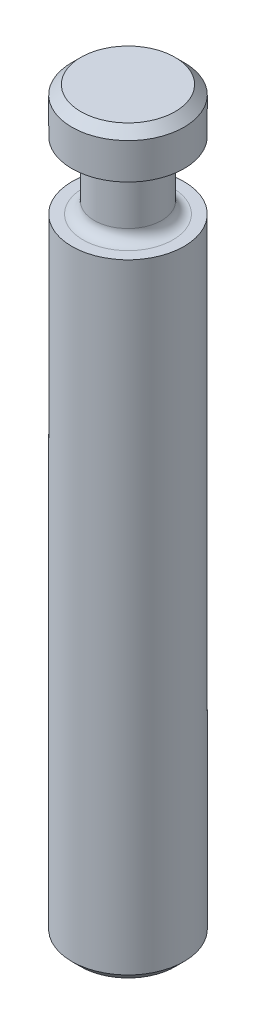
ISO-10303-21;
HEADER;
FILE_DESCRIPTION(('STEP AP214'),'2;1');
FILE_NAME('part.step','',(''),(''),'','','');
FILE_SCHEMA(('AUTOMOTIVE_DESIGN { 1 0 10303 214 1 1 1 1 }'));
ENDSEC;
DATA;
#1=APPLICATION_CONTEXT('core data for automotive mechanical design processes');
#2=APPLICATION_PROTOCOL_DEFINITION('international standard','automotive_design',2000,#1);
#3=PRODUCT_CONTEXT('',#1,'mechanical');
#4=PRODUCT('Part','Part','',(#3));
#5=PRODUCT_RELATED_PRODUCT_CATEGORY('part','',(#4));
#6=PRODUCT_DEFINITION_FORMATION('','',#4);
#7=PRODUCT_DEFINITION_CONTEXT('part definition',#1,'design');
#8=PRODUCT_DEFINITION('design','',#6,#7);
#9=PRODUCT_DEFINITION_SHAPE('','',#8);
#10=(LENGTH_UNIT() NAMED_UNIT(*) SI_UNIT(.MILLI.,.METRE.));
#11=(NAMED_UNIT(*) PLANE_ANGLE_UNIT() SI_UNIT($,.RADIAN.));
#12=(NAMED_UNIT(*) SI_UNIT($,.STERADIAN.) SOLID_ANGLE_UNIT());
#13=UNCERTAINTY_MEASURE_WITH_UNIT(LENGTH_MEASURE(1.E-05),#10,'distance_accuracy_value','');
#14=(GEOMETRIC_REPRESENTATION_CONTEXT(3) GLOBAL_UNCERTAINTY_ASSIGNED_CONTEXT((#13)) GLOBAL_UNIT_ASSIGNED_CONTEXT((#10,
#11,#12)) REPRESENTATION_CONTEXT('',''));
#15=CARTESIAN_POINT('',(0.,0.,0.));
#16=DIRECTION('',(0.,0.,1.));
#17=DIRECTION('',(1.,0.,0.));
#18=AXIS2_PLACEMENT_3D('',#15,#16,#17);
#19=CARTESIAN_POINT('',(0.,-16.5,0.));
#20=DIRECTION('',(0.,1.,0.));
#21=DIRECTION('',(0.,0.,1.));
#22=AXIS2_PLACEMENT_3D('',#19,#20,#21);
#23=CYLINDRICAL_SURFACE('',#22,1.25);
#24=CARTESIAN_POINT('',(0.,-0.200000000000002,0.));
#25=DIRECTION('',(0.,1.,0.));
#26=DIRECTION('',(0.,0.,1.));
#27=AXIS2_PLACEMENT_3D('',#24,#25,#26);
#28=CIRCLE('',#27,1.25);
#29=CARTESIAN_POINT('',(0.,-0.200000000000002,1.25));
#30=VERTEX_POINT('',#29);
#31=EDGE_CURVE('E59',#30,#30,#28,.F.);
#32=ORIENTED_EDGE('',*,*,#31,.T.);
#33=EDGE_LOOP('',(#32));
#34=FACE_BOUND('',#33,.T.);
#35=CARTESIAN_POINT('',(0.,-1.,0.));
#36=DIRECTION('',(0.,-1.,0.));
#37=DIRECTION('',(0.,0.,-1.));
#38=AXIS2_PLACEMENT_3D('',#35,#36,#37);
#39=CIRCLE('',#38,1.25);
#40=CARTESIAN_POINT('',(0.,-1.,-1.25));
#41=VERTEX_POINT('',#40);
#42=EDGE_CURVE('E62',#41,#41,#39,.T.);
#43=ORIENTED_EDGE('',*,*,#42,.F.);
#44=EDGE_LOOP('',(#43));
#45=FACE_BOUND('',#44,.T.);
#46=ADVANCED_FACE('F30',(#34,#45),#23,.T.);
#47=CARTESIAN_POINT('',(0.,0.,0.));
#48=DIRECTION('',(0.,1.,0.));
#49=DIRECTION('',(0.,0.,1.));
#50=AXIS2_PLACEMENT_3D('',#47,#48,#49);
#51=PLANE('',#50);
#52=CARTESIAN_POINT('',(0.,0.,0.));
#53=DIRECTION('',(0.,1.,0.));
#54=DIRECTION('',(0.,0.,1.));
#55=AXIS2_PLACEMENT_3D('',#52,#53,#54);
#56=CIRCLE('',#55,1.05);
#57=CARTESIAN_POINT('',(0.,0.,1.05));
#58=VERTEX_POINT('',#57);
#59=EDGE_CURVE('E50',#58,#58,#56,.T.);
#60=ORIENTED_EDGE('',*,*,#59,.T.);
#61=EDGE_LOOP('',(#60));
#62=FACE_BOUND('',#61,.T.);
#63=ADVANCED_FACE('F72',(#62),#51,.T.);
#64=CARTESIAN_POINT('',(0.,0.,0.));
#65=DIRECTION('',(0.,-1.,0.));
#66=DIRECTION('',(0.,0.,-1.));
#67=AXIS2_PLACEMENT_3D('',#64,#65,#66);
#68=CONICAL_SURFACE('',#67,1.05,0.785398163397446);
#69=ORIENTED_EDGE('',*,*,#31,.F.);
#70=EDGE_LOOP('',(#69));
#71=FACE_BOUND('',#70,.T.);
#72=ORIENTED_EDGE('',*,*,#59,.F.);
#73=EDGE_LOOP('',(#72));
#74=FACE_BOUND('',#73,.T.);
#75=ADVANCED_FACE('F79',(#71,#74),#68,.T.);
#76=CARTESIAN_POINT('',(0.,-1.,0.));
#77=DIRECTION('',(0.,-1.,0.));
#78=DIRECTION('',(0.,0.,-1.));
#79=AXIS2_PLACEMENT_3D('',#76,#77,#78);
#80=PLANE('',#79);
#81=CARTESIAN_POINT('',(0.,-1.,0.));
#82=DIRECTION('',(0.,-1.,0.));
#83=DIRECTION('',(0.,0.,-1.));
#84=AXIS2_PLACEMENT_3D('',#81,#82,#83);
#85=CIRCLE('',#84,1.);
#86=CARTESIAN_POINT('',(0.,-1.,-1.));
#87=VERTEX_POINT('',#86);
#88=EDGE_CURVE('E37',#87,#87,#85,.F.);
#89=ORIENTED_EDGE('',*,*,#88,.T.);
#90=EDGE_LOOP('',(#89));
#91=FACE_BOUND('',#90,.T.);
#92=ORIENTED_EDGE('',*,*,#42,.T.);
#93=EDGE_LOOP('',(#92));
#94=FACE_BOUND('',#93,.T.);
#95=ADVANCED_FACE('F69',(#91,#94),#80,.T.);
#96=CARTESIAN_POINT('',(0.,-2.5,0.));
#97=DIRECTION('',(0.,-1.,0.));
#98=DIRECTION('',(0.,0.,-1.));
#99=AXIS2_PLACEMENT_3D('',#96,#97,#98);
#100=PLANE('',#99);
#101=CARTESIAN_POINT('',(0.,-2.5,0.));
#102=DIRECTION('',(0.,-1.,0.));
#103=DIRECTION('',(0.,0.,-1.));
#104=AXIS2_PLACEMENT_3D('',#101,#102,#103);
#105=CIRCLE('',#104,1.);
#106=CARTESIAN_POINT('',(0.,-2.5,-1.));
#107=VERTEX_POINT('',#106);
#108=EDGE_CURVE('E10',#107,#107,#105,.T.);
#109=ORIENTED_EDGE('',*,*,#108,.T.);
#110=EDGE_LOOP('',(#109));
#111=FACE_BOUND('',#110,.T.);
#112=CARTESIAN_POINT('',(0.,-2.5,0.));
#113=DIRECTION('',(0.,-1.,0.));
#114=DIRECTION('',(0.,0.,-1.));
#115=AXIS2_PLACEMENT_3D('',#112,#113,#114);
#116=CIRCLE('',#115,1.25);
#117=CARTESIAN_POINT('',(0.,-2.5,-1.25));
#118=VERTEX_POINT('',#117);
#119=EDGE_CURVE('E63',#118,#118,#116,.T.);
#120=ORIENTED_EDGE('',*,*,#119,.F.);
#121=EDGE_LOOP('',(#120));
#122=FACE_BOUND('',#121,.T.);
#123=ADVANCED_FACE('F99',(#111,#122),#100,.F.);
#124=CARTESIAN_POINT('',(0.,-1.,0.));
#125=DIRECTION('',(0.,-1.,0.));
#126=DIRECTION('',(0.,0.,-1.));
#127=AXIS2_PLACEMENT_3D('',#124,#125,#126);
#128=CYLINDRICAL_SURFACE('',#127,0.75);
#129=CARTESIAN_POINT('',(0.,-1.25,0.));
#130=DIRECTION('',(0.,-1.,0.));
#131=DIRECTION('',(0.,0.,-1.));
#132=AXIS2_PLACEMENT_3D('',#129,#130,#131);
#133=CIRCLE('',#132,0.75);
#134=CARTESIAN_POINT('',(0.,-1.25,-0.75));
#135=VERTEX_POINT('',#134);
#136=EDGE_CURVE('E41',#135,#135,#133,.T.);
#137=ORIENTED_EDGE('',*,*,#136,.T.);
#138=EDGE_LOOP('',(#137));
#139=FACE_BOUND('',#138,.T.);
#140=CARTESIAN_POINT('',(0.,-2.25,0.));
#141=DIRECTION('',(0.,-1.,0.));
#142=DIRECTION('',(0.,0.,-1.));
#143=AXIS2_PLACEMENT_3D('',#140,#141,#142);
#144=CIRCLE('',#143,0.75);
#145=CARTESIAN_POINT('',(0.,-2.25,-0.75));
#146=VERTEX_POINT('',#145);
#147=EDGE_CURVE('E45',#146,#146,#144,.F.);
#148=ORIENTED_EDGE('',*,*,#147,.T.);
#149=EDGE_LOOP('',(#148));
#150=FACE_BOUND('',#149,.T.);
#151=ADVANCED_FACE('F101',(#139,#150),#128,.T.);
#152=CARTESIAN_POINT('',(0.,-16.5,0.));
#153=DIRECTION('',(0.,1.,0.));
#154=DIRECTION('',(0.,0.,1.));
#155=AXIS2_PLACEMENT_3D('',#152,#153,#154);
#156=PLANE('',#155);
#157=CARTESIAN_POINT('',(0.,-16.5,0.));
#158=DIRECTION('',(0.,1.,0.));
#159=DIRECTION('',(0.,0.,1.));
#160=AXIS2_PLACEMENT_3D('',#157,#158,#159);
#161=CIRCLE('',#160,1.05);
#162=CARTESIAN_POINT('',(0.,-16.5,1.05));
#163=VERTEX_POINT('',#162);
#164=EDGE_CURVE('E53',#163,#163,#161,.F.);
#165=ORIENTED_EDGE('',*,*,#164,.T.);
#166=EDGE_LOOP('',(#165));
#167=FACE_BOUND('',#166,.T.);
#168=ADVANCED_FACE('F92',(#167),#156,.F.);
#169=CARTESIAN_POINT('',(0.,-16.3,0.));
#170=DIRECTION('',(0.,1.,0.));
#171=DIRECTION('',(0.,0.,1.));
#172=AXIS2_PLACEMENT_3D('',#169,#170,#171);
#173=CONICAL_SURFACE('',#172,1.25,0.785398163397446);
#174=ORIENTED_EDGE('',*,*,#164,.F.);
#175=EDGE_LOOP('',(#174));
#176=FACE_BOUND('',#175,.T.);
#177=CARTESIAN_POINT('',(0.,-16.3,0.));
#178=DIRECTION('',(0.,1.,0.));
#179=DIRECTION('',(0.,0.,1.));
#180=AXIS2_PLACEMENT_3D('',#177,#178,#179);
#181=CIRCLE('',#180,1.25);
#182=CARTESIAN_POINT('',(0.,-16.3,1.25));
#183=VERTEX_POINT('',#182);
#184=EDGE_CURVE('E56',#183,#183,#181,.T.);
#185=ORIENTED_EDGE('',*,*,#184,.F.);
#186=EDGE_LOOP('',(#185));
#187=FACE_BOUND('',#186,.T.);
#188=ADVANCED_FACE('F85',(#176,#187),#173,.T.);
#189=ORIENTED_EDGE('',*,*,#119,.T.);
#190=EDGE_LOOP('',(#189));
#191=FACE_BOUND('',#190,.T.);
#192=ORIENTED_EDGE('',*,*,#184,.T.);
#193=EDGE_LOOP('',(#192));
#194=FACE_BOUND('',#193,.T.);
#195=ADVANCED_FACE('F75',(#191,#194),#23,.T.);
#196=CARTESIAN_POINT('',(0.,-1.25,0.));
#197=DIRECTION('',(0.,-1.,0.));
#198=DIRECTION('',(0.,0.,-1.));
#199=AXIS2_PLACEMENT_3D('',#196,#197,#198);
#200=TOROIDAL_SURFACE('',#199,1.,0.25);
#201=ORIENTED_EDGE('',*,*,#88,.F.);
#202=EDGE_LOOP('',(#201));
#203=FACE_BOUND('',#202,.T.);
#204=ORIENTED_EDGE('',*,*,#136,.F.);
#205=EDGE_LOOP('',(#204));
#206=FACE_BOUND('',#205,.T.);
#207=ADVANCED_FACE('F84',(#203,#206),#200,.F.);
#208=CARTESIAN_POINT('',(0.,-2.25,0.));
#209=DIRECTION('',(0.,-1.,0.));
#210=DIRECTION('',(0.,0.,-1.));
#211=AXIS2_PLACEMENT_3D('',#208,#209,#210);
#212=TOROIDAL_SURFACE('',#211,1.,0.25);
#213=ORIENTED_EDGE('',*,*,#147,.F.);
#214=EDGE_LOOP('',(#213));
#215=FACE_BOUND('',#214,.T.);
#216=ORIENTED_EDGE('',*,*,#108,.F.);
#217=EDGE_LOOP('',(#216));
#218=FACE_BOUND('',#217,.T.);
#219=ADVANCED_FACE('F32',(#215,#218),#212,.F.);
#220=CLOSED_SHELL('',(#46,#63,#75,#95,#123,#151,#168,#188,#195,#207,#219));
#221=MANIFOLD_SOLID_BREP('B2',#220);
#222=ADVANCED_BREP_SHAPE_REPRESENTATION('',(#18,#221),#14);
#223=SHAPE_DEFINITION_REPRESENTATION(#9,#222);
ENDSEC;
END-ISO-10303-21;
